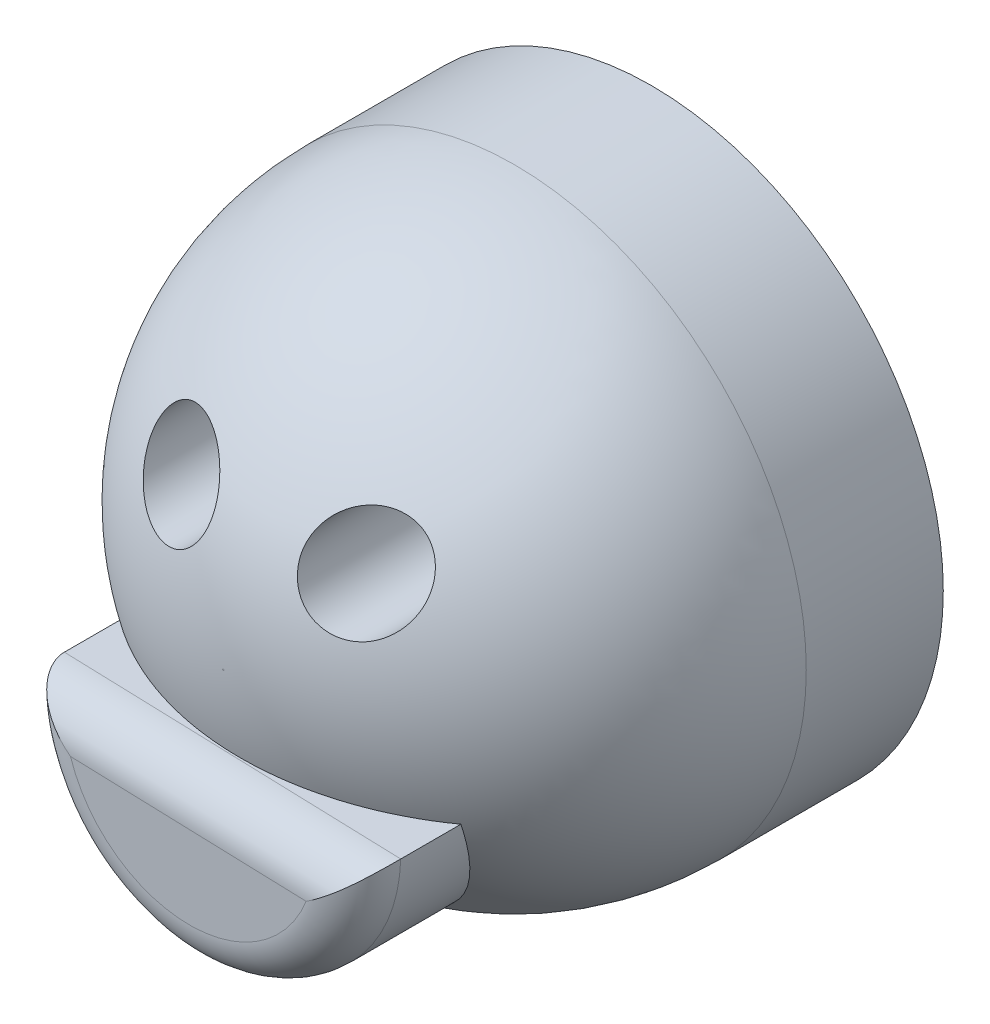
ISO-10303-21;
HEADER;
FILE_DESCRIPTION(('STEP AP214'),'2;1');
FILE_NAME('part.step','',(''),(''),'','','');
FILE_SCHEMA(('AUTOMOTIVE_DESIGN { 1 0 10303 214 1 1 1 1 }'));
ENDSEC;
DATA;
#1=APPLICATION_CONTEXT('core data for automotive mechanical design processes');
#2=APPLICATION_PROTOCOL_DEFINITION('international standard','automotive_design',2000,#1);
#3=PRODUCT_CONTEXT('',#1,'mechanical');
#4=PRODUCT('Part','Part','',(#3));
#5=PRODUCT_RELATED_PRODUCT_CATEGORY('part','',(#4));
#6=PRODUCT_DEFINITION_FORMATION('','',#4);
#7=PRODUCT_DEFINITION_CONTEXT('part definition',#1,'design');
#8=PRODUCT_DEFINITION('design','',#6,#7);
#9=PRODUCT_DEFINITION_SHAPE('','',#8);
#10=(LENGTH_UNIT() NAMED_UNIT(*) SI_UNIT(.MILLI.,.METRE.));
#11=(NAMED_UNIT(*) PLANE_ANGLE_UNIT() SI_UNIT($,.RADIAN.));
#12=(NAMED_UNIT(*) SI_UNIT($,.STERADIAN.) SOLID_ANGLE_UNIT());
#13=UNCERTAINTY_MEASURE_WITH_UNIT(LENGTH_MEASURE(1.E-05),#10,'distance_accuracy_value','');
#14=(GEOMETRIC_REPRESENTATION_CONTEXT(3) GLOBAL_UNCERTAINTY_ASSIGNED_CONTEXT((#13)) GLOBAL_UNIT_ASSIGNED_CONTEXT((#10,
#11,#12)) REPRESENTATION_CONTEXT('',''));
#15=CARTESIAN_POINT('',(0.,0.,0.));
#16=DIRECTION('',(0.,0.,1.));
#17=DIRECTION('',(1.,0.,0.));
#18=AXIS2_PLACEMENT_3D('',#15,#16,#17);
#19=CARTESIAN_POINT('',(-9.25737723848741,12.8505214496792,57.));
#20=DIRECTION('',(0.,0.,-1.));
#21=DIRECTION('',(-1.,0.,0.));
#22=AXIS2_PLACEMENT_3D('',#19,#20,#21);
#23=CYLINDRICAL_SURFACE('',#22,5.5);
#24=CARTESIAN_POINT('',(-12.9072072028845,16.9649766057103,42.5477959091102));
#25=CARTESIAN_POINT('',(-13.0140604511853,16.8701891517838,42.5563873106308));
#26=CARTESIAN_POINT('',(-13.1170758880721,16.7713597964741,42.5682582121675));
#27=CARTESIAN_POINT('',(-13.3147178261177,16.5664684033086,42.5983704048194));
#28=CARTESIAN_POINT('',(-13.4093404121222,16.4604030303369,42.6166146496213));
#29=CARTESIAN_POINT('',(-13.5897015599936,16.2418444617009,42.6592190220472));
#30=CARTESIAN_POINT('',(-13.6754258679522,16.1293413875084,42.6835887546428));
#31=CARTESIAN_POINT('',(-13.8374136016537,15.898981059377,42.7380789757917));
#32=CARTESIAN_POINT('',(-13.9136730116155,15.7811215615834,42.7682018916464));
#33=CARTESIAN_POINT('',(-14.0560204152741,15.5416764065529,42.8336078836441));
#34=CARTESIAN_POINT('',(-14.1221600944632,15.4201137656634,42.8688628121162));
#35=CARTESIAN_POINT('',(-14.2446054670298,15.1735641710642,42.9442145829014));
#36=CARTESIAN_POINT('',(-14.3009074657991,15.0485759511539,42.9843132347869));
#37=CARTESIAN_POINT('',(-14.454857651207,14.6699422650967,43.1111506170001));
#38=CARTESIAN_POINT('',(-14.5377154121831,14.4123463553259,43.2045085848092));
#39=CARTESIAN_POINT('',(-14.6691007064146,13.8733152917599,43.4128768338721));
#40=CARTESIAN_POINT('',(-14.7145081868092,13.5915669035247,43.5289985520606));
#41=CARTESIAN_POINT('',(-14.7616881300874,13.0296894637786,43.7734021902099));
#42=CARTESIAN_POINT('',(-14.7634390483365,12.7495612800146,43.9016900828656));
#43=CARTESIAN_POINT('',(-14.7227768183386,12.1587353695515,44.1848382866665));
#44=CARTESIAN_POINT('',(-14.6743397812629,11.8490463305635,44.340942380525));
#45=CARTESIAN_POINT('',(-14.5271092923104,11.2453591427245,44.6596744689687));
#46=CARTESIAN_POINT('',(-14.4282896900209,10.9513692299288,44.8223058110116));
#47=CARTESIAN_POINT('',(-14.1710647026199,10.3562882313705,45.1668199242544));
#48=CARTESIAN_POINT('',(-14.0076098553691,10.0575312709706,45.3489743842794));
#49=CARTESIAN_POINT('',(-13.6277670948659,9.49418275185944,45.7115846485517));
#50=CARTESIAN_POINT('',(-13.4113626307013,9.22960191545685,45.8920399033129));
#51=CARTESIAN_POINT('',(-13.0475652668029,8.8610915053749,46.1602677255554));
#52=CARTESIAN_POINT('',(-12.9175600985739,8.7414511789301,46.2505703404357));
#53=CARTESIAN_POINT('',(-12.6456794842515,8.51454241653131,46.4287643814814));
#54=CARTESIAN_POINT('',(-12.5038090474399,8.40726880463527,46.5166568045789));
#55=CARTESIAN_POINT('',(-12.2089926362081,8.20618856060068,46.6893998287366));
#56=CARTESIAN_POINT('',(-12.0560421432269,8.11238746973621,46.7742491674661));
#57=CARTESIAN_POINT('',(-11.7401840827872,7.93950747853151,46.9401333329919));
#58=CARTESIAN_POINT('',(-11.5772818564354,7.86042077158814,47.021170165335));
#59=CARTESIAN_POINT('',(-11.2514307253294,7.72183480327307,47.1745912012373));
#60=CARTESIAN_POINT('',(-11.0889361714544,7.66152328058421,47.2472063320046));
#61=CARTESIAN_POINT('',(-10.7572046364165,7.55611057745018,47.3877233113489));
#62=CARTESIAN_POINT('',(-10.5879711922357,7.51100153246962,47.455627582461));
#63=CARTESIAN_POINT('',(-10.2440510656069,7.4368897342342,47.5860801427284));
#64=CARTESIAN_POINT('',(-10.0693661430575,7.40788183871743,47.6486301364878));
#65=CARTESIAN_POINT('',(-9.71600008185808,7.36679177396061,47.767722236032));
#66=CARTESIAN_POINT('',(-9.5373194733823,7.3547073725788,47.8242651332197));
#67=CARTESIAN_POINT('',(-9.1969369148355,7.34850898638994,47.9249739543726));
#68=CARTESIAN_POINT('',(-9.03546653496261,7.35260866186317,47.969816887475));
#69=CARTESIAN_POINT('',(-8.71203824333144,7.3752246841211,48.0537200011101));
#70=CARTESIAN_POINT('',(-8.55008040206013,7.39373903773683,48.0927809802457));
#71=CARTESIAN_POINT('',(-8.22721404795284,7.44538724144292,48.1646673681743));
#72=CARTESIAN_POINT('',(-8.06630494636016,7.47851201291305,48.1974966311393));
#73=CARTESIAN_POINT('',(-7.7469777311678,7.5594145446557,48.2565563997379));
#74=CARTESIAN_POINT('',(-7.58855936545461,7.60719081172706,48.2827875773171));
#75=CARTESIAN_POINT('',(-7.29263845514121,7.71129064321229,48.3258719717466));
#76=CARTESIAN_POINT('',(-7.15471886997797,7.76614227416268,48.3434303807959));
#77=CARTESIAN_POINT('',(-6.8832740520946,7.88708464451781,48.3728466584016));
#78=CARTESIAN_POINT('',(-6.74974841780397,7.95317435343207,48.3847050492476));
#79=CARTESIAN_POINT('',(-6.48825395870084,8.09613879049406,48.4025905867804));
#80=CARTESIAN_POINT('',(-6.36028319951789,8.17300972420271,48.4086197791789));
#81=CARTESIAN_POINT('',(-6.11092047162358,8.3369780856974,48.4147875037095));
#82=CARTESIAN_POINT('',(-5.98952832037686,8.42407522952623,48.4149261993678));
#83=CARTESIAN_POINT('',(-5.76145008403218,8.60221035308469,48.4094826996638));
#84=CARTESIAN_POINT('',(-5.65431860697311,8.69268974604557,48.4042466494968));
#85=CARTESIAN_POINT('',(-5.44744299149838,8.88138960075264,48.3886249502624));
#86=CARTESIAN_POINT('',(-5.34770126491339,8.97961256840795,48.3782376283838));
#87=CARTESIAN_POINT('',(-5.15633597562459,9.18296832857103,48.3524177139507));
#88=CARTESIAN_POINT('',(-5.06470888440285,9.28809808279061,48.3369873281177));
#89=CARTESIAN_POINT('',(-4.89003323300438,9.50453049711651,48.3012184059297));
#90=CARTESIAN_POINT('',(-4.80698791151042,9.6158354635144,48.2808780261777));
#91=CARTESIAN_POINT('',(-4.64964251986597,9.84418276024531,48.2353847089241));
#92=CARTESIAN_POINT('',(-4.57537745670499,9.96124558514763,48.2102134915766));
#93=CARTESIAN_POINT('',(-4.43627736998531,10.1998427063166,48.1553295851225));
#94=CARTESIAN_POINT('',(-4.37144573358963,10.3213785891491,48.1256152725886));
#95=CARTESIAN_POINT('',(-4.1915175475601,10.6913293966694,48.0300235297009));
#96=CARTESIAN_POINT('',(-4.09086256834381,10.9452705643238,47.9576606481871));
#97=CARTESIAN_POINT('',(-3.92411004236922,11.4763117123146,47.7930568792736));
#98=CARTESIAN_POINT('',(-3.86047774171968,11.7538823209946,47.6998767889795));
#99=CARTESIAN_POINT('',(-3.77672643829429,12.3104261583527,47.4992830972338));
#100=CARTESIAN_POINT('',(-3.7566231049492,12.5893998559013,47.3918643849661));
#101=CARTESIAN_POINT('',(-3.75824936294008,13.169133259573,47.1545399321331));
#102=CARTESIAN_POINT('',(-3.78419991409371,13.4693996326367,47.0234646237229));
#103=CARTESIAN_POINT('',(-3.88307888847881,14.0570943266708,46.7507596073395));
#104=CARTESIAN_POINT('',(-3.9560275044973,14.3445170725682,46.6091253858552));
#105=CARTESIAN_POINT('',(-4.15520750784627,14.9297197048802,46.3032603356111));
#106=CARTESIAN_POINT('',(-4.28620142466807,15.2254547996055,46.1382132113792));
#107=CARTESIAN_POINT('',(-4.59613429052784,15.7875094903289,45.8030548950285));
#108=CARTESIAN_POINT('',(-4.77509370739228,16.0538164600907,45.6329415686714));
#109=CARTESIAN_POINT('',(-5.1914264413742,16.5702532918545,45.2784374132687));
#110=CARTESIAN_POINT('',(-5.43223969583345,16.8175527982918,45.0939570252271));
#111=CARTESIAN_POINT('',(-5.95771684512472,17.2642570289073,44.7286772221704));
#112=CARTESIAN_POINT('',(-6.24239470674187,17.4636464462555,44.5478790004139));
#113=CARTESIAN_POINT('',(-6.69854147585041,17.7222240999347,44.2829925535192));
#114=CARTESIAN_POINT('',(-6.85651916279371,17.8020321691597,44.1952239604207));
#115=CARTESIAN_POINT('',(-7.1809083446437,17.9465747755711,44.0229848076844));
#116=CARTESIAN_POINT('',(-7.34731582070793,18.011316414735,43.9385127098454));
#117=CARTESIAN_POINT('',(-7.68756804514196,18.1247876030159,43.773725358126));
#118=CARTESIAN_POINT('',(-7.86141535361511,18.1735115894429,43.6934115565001));
#119=CARTESIAN_POINT('',(-8.21517441088773,18.2539171346284,43.5379959625934));
#120=CARTESIAN_POINT('',(-8.3950823524512,18.2856091881081,43.4628909856519));
#121=CARTESIAN_POINT('',(-8.74524975668017,18.3292401892542,43.3245894771292));
#122=CARTESIAN_POINT('',(-8.91515324490112,18.3425382183777,43.2609209233383));
#123=CARTESIAN_POINT('',(-9.25756845583482,18.3531858314086,43.1397981421652));
#124=CARTESIAN_POINT('',(-9.4300785517468,18.3505449835324,43.0823402075913));
#125=CARTESIAN_POINT('',(-9.77621599596526,18.3287387738394,42.9745460268087));
#126=CARTESIAN_POINT('',(-9.94984283936479,18.3095804212292,42.9242067703331));
#127=CARTESIAN_POINT('',(-10.2965354313587,18.2543110476827,42.8315561815373));
#128=CARTESIAN_POINT('',(-10.4696012997145,18.2182039231522,42.7892430072138));
#129=CARTESIAN_POINT('',(-10.7886763589346,18.1352434155688,42.7189292919516));
#130=CARTESIAN_POINT('',(-10.9350190250191,18.0906619117056,42.689747642346));
#131=CARTESIAN_POINT('',(-11.2245450294945,17.9889822010971,42.6384146762699));
#132=CARTESIAN_POINT('',(-11.3677289611456,17.9318863671522,42.6162620289998));
#133=CARTESIAN_POINT('',(-11.6492522764025,17.805587885541,42.57942834047));
#134=CARTESIAN_POINT('',(-11.7876020438642,17.7364133821503,42.5647302337492));
#135=CARTESIAN_POINT('',(-12.0583666567901,17.5863837708901,42.5430169016915));
#136=CARTESIAN_POINT('',(-12.1907847519212,17.5055351638104,42.5359974190042));
#137=CARTESIAN_POINT('',(-12.4225361921581,17.3502033310563,42.53038950624));
#138=CARTESIAN_POINT('',(-12.5231730645919,17.277702724159,42.5303909531178));
#139=CARTESIAN_POINT('',(-12.7192350326404,17.1261372408744,42.5353738215406));
#140=CARTESIAN_POINT('',(-12.8146605769501,17.0470729311035,42.5403548136319));
#141=CARTESIAN_POINT('',(-12.9072072028845,16.9649766057103,42.5477959091102));
#142=B_SPLINE_CURVE_WITH_KNOTS('',3,(#24,#25,#26,#27,#28,#29,#30,#31,#32,#33,#34,#35,#36,#37,
#38,#39,#40,#41,#42,#43,#44,#45,#46,#47,#48,#49,#50,#51,#52,#53,#54,#55,#56,#57,#58,#59,#60,#61,
#62,#63,#64,#65,#66,#67,#68,#69,#70,#71,#72,#73,#74,#75,#76,#77,#78,#79,#80,#81,#82,#83,#84,#85,
#86,#87,#88,#89,#90,#91,#92,#93,#94,#95,#96,#97,#98,#99,#100,#101,#102,#103,#104,#105,#106,#107,
#108,#109,#110,#111,#112,#113,#114,#115,#116,#117,#118,#119,#120,#121,#122,#123,#124,#125,#126,
#127,#128,#129,#130,#131,#132,#133,#134,#135,#136,#137,#138,#139,#140,#141),.UNSPECIFIED.,.T.,
.F.,(4,2,2,2,2,2,2,2,2,2,2,2,2,2,2,2,2,2,2,2,2,2,2,2,2,2,2,2,2,2,2,2,2,2,2,2,2,2,2,2,2,2,2,2,2,
2,2,2,2,2,2,2,2,2,2,2,2,2,4),(0.,0.429156608893507,0.858512372219872,1.28854562621691,
1.71876071613443,2.14669938242189,2.57479842017683,3.43000107390439,4.35078834099497,
5.27203001016448,6.31825492510995,7.36502342309644,8.51855783251592,9.67245327366315,
10.2670814082643,10.8614597577343,11.4560818803659,12.0503876255696,12.6133919588368,
13.1761045904025,13.7386374035564,14.3010960138731,14.8033035638609,15.3054416841494,
15.8072682245018,16.3090436383955,16.7568519487563,17.2046192188607,17.6522292914413,
18.099826937907,18.5203026356711,18.9409149671652,19.3613434948465,19.7819301134367,
20.2041407778558,20.6265026689676,21.4705598384495,22.3657925837612,23.2613475388077,
24.2432623299694,25.2255992838539,26.3103606225963,27.3955855894336,28.5644825907183,
29.7337525486915,30.3257874485861,30.9175427086477,31.5095032598426,32.1010986378842,
32.6461032899422,33.1907808045525,33.7352272988403,34.2795486898858,34.7461145519053,
35.2125920263344,35.6779967320365,36.1431432669055,36.5148719894116,36.8865686554668),.UNSPECIFIED.);
#143=CARTESIAN_POINT('',(-12.9072072028845,16.9649766057103,42.5477959091102));
#144=VERTEX_POINT('',#143);
#145=EDGE_CURVE('E148',#144,#144,#142,.T.);
#146=ORIENTED_EDGE('',*,*,#145,.T.);
#147=EDGE_LOOP('',(#146));
#148=FACE_BOUND('',#147,.T.);
#149=CARTESIAN_POINT('',(-9.25737723848741,12.8505214496792,27.));
#150=DIRECTION('',(0.,0.,-1.));
#151=DIRECTION('',(-1.,0.,0.));
#152=AXIS2_PLACEMENT_3D('',#149,#150,#151);
#153=CIRCLE('',#152,5.5);
#154=CARTESIAN_POINT('',(-14.7573772384874,12.8505214496792,27.));
#155=VERTEX_POINT('',#154);
#156=EDGE_CURVE('E164',#155,#155,#153,.F.);
#157=ORIENTED_EDGE('',*,*,#156,.F.);
#158=EDGE_LOOP('',(#157));
#159=FACE_BOUND('',#158,.T.);
#160=ADVANCED_FACE('F41',(#148,#159),#23,.F.);
#161=CARTESIAN_POINT('',(11.4272316677599,12.8505214496792,57.));
#162=DIRECTION('',(0.,0.,-1.));
#163=DIRECTION('',(-1.,0.,0.));
#164=AXIS2_PLACEMENT_3D('',#161,#162,#163);
#165=CYLINDRICAL_SURFACE('',#164,5.5);
#166=CARTESIAN_POINT('',(15.2593620584543,16.7957434546768,41.386080964578));
#167=CARTESIAN_POINT('',(15.1630712113056,16.8892793943901,41.382089837552));
#168=CARTESIAN_POINT('',(15.0633025691665,16.9793259389152,41.3814197342294));
#169=CARTESIAN_POINT('',(14.8575140852864,17.1518208012796,41.3867183957662));
#170=CARTESIAN_POINT('',(14.7514931774445,17.2342678171115,41.3926882959592));
#171=CARTESIAN_POINT('',(14.5340448845873,17.3909712852645,41.4111731465244));
#172=CARTESIAN_POINT('',(14.4226152160776,17.4652242341032,41.4236908834822));
#173=CARTESIAN_POINT('',(14.19525640845,17.6050835723007,41.4550659515435));
#174=CARTESIAN_POINT('',(14.0793254992107,17.6706865145213,41.4739257994933));
#175=CARTESIAN_POINT('',(13.8443878752612,17.7926667853016,41.5175981907555));
#176=CARTESIAN_POINT('',(13.725395090283,17.8490794692541,41.5423869702517));
#177=CARTESIAN_POINT('',(13.4847739830331,17.9528459433099,41.5975866612467));
#178=CARTESIAN_POINT('',(13.3631446679101,18.0001962523783,41.6279997243579));
#179=CARTESIAN_POINT('',(12.9956702697736,18.1285118417737,41.7270505717172));
#180=CARTESIAN_POINT('',(12.7470363036936,18.1958457030698,41.8035384260418));
#181=CARTESIAN_POINT('',(12.2345506153206,18.2975820664919,41.9786524077705));
#182=CARTESIAN_POINT('',(11.9706430101019,18.3298772691214,42.07829568162));
#183=CARTESIAN_POINT('',(11.447182403148,18.3567299396451,42.2928115947896));
#184=CARTESIAN_POINT('',(11.1876312073753,18.3512721262253,42.4076903825436));
#185=CARTESIAN_POINT('',(10.6367761056727,18.3015118244145,42.6681578078188));
#186=CARTESIAN_POINT('',(10.3469565436511,18.2511920377892,42.8157283222068));
#187=CARTESIAN_POINT('',(9.78418179372839,18.107406916347,43.1215961196392));
#188=CARTESIAN_POINT('',(9.51123725229884,18.013914652658,43.279900045002));
#189=CARTESIAN_POINT('',(8.94593858044634,17.7700746492881,43.6281860196268));
#190=CARTESIAN_POINT('',(8.65709375042506,17.613177514163,43.819285487885));
#191=CARTESIAN_POINT('',(8.11319627953188,17.2520803083736,44.2053102796269));
#192=CARTESIAN_POINT('',(7.85816140467886,17.047855522253,44.4002375532183));
#193=CARTESIAN_POINT('',(7.49458851592821,16.6996781528609,44.7007831322127));
#194=CARTESIAN_POINT('',(7.37205462480495,16.5703778400781,44.8068248046676));
#195=CARTESIAN_POINT('',(7.139753319713,16.3000514378295,45.0179034409505));
#196=CARTESIAN_POINT('',(7.02998170408291,16.159029233876,45.1229407249367));
#197=CARTESIAN_POINT('',(6.82409641722177,15.8660207831036,45.3313676505475));
#198=CARTESIAN_POINT('',(6.72799212983496,15.7140271103047,45.4347561172808));
#199=CARTESIAN_POINT('',(6.55057237787206,15.4001629005672,45.6390380486835));
#200=CARTESIAN_POINT('',(6.46925008824909,15.2382969681251,45.7399326461183));
#201=CARTESIAN_POINT('',(6.3228857735391,14.9067944612122,45.9378381016312));
#202=CARTESIAN_POINT('',(6.25773697252118,14.7372181004085,46.034870675701));
#203=CARTESIAN_POINT('',(6.14408065667565,14.3905138348796,46.2249422679488));
#204=CARTESIAN_POINT('',(6.09556523838111,14.2133895617044,46.3179831643627));
#205=CARTESIAN_POINT('',(6.01618725247276,13.8528517885503,46.4992798181458));
#206=CARTESIAN_POINT('',(5.98532274578265,13.6694389817582,46.5875361001738));
#207=CARTESIAN_POINT('',(5.94226341190129,13.2978405241342,46.7583864834211));
#208=CARTESIAN_POINT('',(5.93006596866072,13.1096555458448,46.8409813764918));
#209=CARTESIAN_POINT('',(5.92551087050219,12.7490122610575,46.991749221165));
#210=CARTESIAN_POINT('',(5.93131346194215,12.5768354514235,47.0605409623662));
#211=CARTESIAN_POINT('',(5.95943178269011,12.2315229417678,47.192059572055));
#212=CARTESIAN_POINT('',(5.98174452482413,12.0583874208288,47.2547875353381));
#213=CARTESIAN_POINT('',(6.04330551271311,11.7129384934886,47.3734143328792));
#214=CARTESIAN_POINT('',(6.08253944463368,11.5406245164169,47.4293188879717));
#215=CARTESIAN_POINT('',(6.17819320235755,11.1985152609017,47.5336356835453));
#216=CARTESIAN_POINT('',(6.23461000406013,11.0287195447667,47.5820492401462));
#217=CARTESIAN_POINT('',(6.35561921804147,10.716806688413,47.6645677407794));
#218=CARTESIAN_POINT('',(6.41800324571157,10.574108146075,47.6997255117378));
#219=CARTESIAN_POINT('',(6.55532587005777,10.2933867257638,47.7635658111889));
#220=CARTESIAN_POINT('',(6.63026250766795,10.155363122215,47.7922493484677));
#221=CARTESIAN_POINT('',(6.79225914823926,9.88542570506671,47.8427751115188));
#222=CARTESIAN_POINT('',(6.87931130769202,9.75350801158735,47.8646217339737));
#223=CARTESIAN_POINT('',(7.0649859807424,9.49703560363109,47.9012134109504));
#224=CARTESIAN_POINT('',(7.16360747727383,9.37248024337338,47.9159590891387));
#225=CARTESIAN_POINT('',(7.36025674651174,9.14514998368258,47.9369399299893));
#226=CARTESIAN_POINT('',(7.45717448447346,9.04148163666993,47.9439283118399));
#227=CARTESIAN_POINT('',(7.65886060852433,8.84184239233224,47.9520378884992));
#228=CARTESIAN_POINT('',(7.76362846785999,8.74587097942587,47.9531594766204));
#229=CARTESIAN_POINT('',(7.98018785003957,8.5623953238768,47.9495237270903));
#230=CARTESIAN_POINT('',(8.09197754184119,8.47488888886485,47.944767916063));
#231=CARTESIAN_POINT('',(8.32172076220291,8.30894896578811,47.9294326147258));
#232=CARTESIAN_POINT('',(8.43967428557736,8.23051547009041,47.9188531293154));
#233=CARTESIAN_POINT('',(8.67630676835222,8.08597371043681,47.8924861954577));
#234=CARTESIAN_POINT('',(8.79479562656146,8.01951556504512,47.8769070517148));
#235=CARTESIAN_POINT('',(9.03576947190353,7.89580066197374,47.8406043579031));
#236=CARTESIAN_POINT('',(9.15825575295167,7.83854691990273,47.8198791274745));
#237=CARTESIAN_POINT('',(9.40626192667091,7.73350954092234,47.7734890202349));
#238=CARTESIAN_POINT('',(9.53178084570937,7.68572290874588,47.7478257108478));
#239=CARTESIAN_POINT('',(9.78506208074046,7.59969510073901,47.6917752811693));
#240=CARTESIAN_POINT('',(9.91282522914106,7.56145755034892,47.6613863738233));
#241=CARTESIAN_POINT('',(10.1745240047296,7.49331352674913,47.5949225376464));
#242=CARTESIAN_POINT('',(10.3085116960981,7.46377237391191,47.5586773812868));
#243=CARTESIAN_POINT('',(10.5770739725136,7.41490845652201,47.481688111214));
#244=CARTESIAN_POINT('',(10.7116487526721,7.39558939937597,47.4409423716715));
#245=CARTESIAN_POINT('',(11.1149362634672,7.35275491226462,47.3124369397168));
#246=CARTESIAN_POINT('',(11.3833831206706,7.34431853120388,47.2183653876275));
#247=CARTESIAN_POINT('',(11.9380129544381,7.36661023775826,47.0066403208464));
#248=CARTESIAN_POINT('',(12.2234995194015,7.40108386291314,46.8876028386535));
#249=CARTESIAN_POINT('',(12.7799470204244,7.51191606136265,46.6359008865442));
#250=CARTESIAN_POINT('',(13.0509013854064,7.58829341002629,46.5032303298684));
#251=CARTESIAN_POINT('',(13.6054493533355,7.79059792616674,46.2103592555308));
#252=CARTESIAN_POINT('',(13.8865134567931,7.92145556666814,46.048778302251));
#253=CARTESIAN_POINT('',(14.4188018066871,8.22510077601109,45.7161896832524));
#254=CARTESIAN_POINT('',(14.6700111115327,8.39790920965325,45.5451773595237));
#255=CARTESIAN_POINT('',(15.1658488028618,8.8024658822429,45.1768743325006));
#256=CARTESIAN_POINT('',(15.406243012369,9.03875165854647,44.9788554041236));
#257=CARTESIAN_POINT('',(15.8394443675669,9.54981213036256,44.5803046051688));
#258=CARTESIAN_POINT('',(16.0322306324498,9.82460363192847,44.3797716723244));
#259=CARTESIAN_POINT('',(16.3769163724496,10.4258836597629,43.9674364641364));
#260=CARTESIAN_POINT('',(16.525103090299,10.7546255852136,43.7558049756787));
#261=CARTESIAN_POINT('',(16.7557317643588,11.4405969021131,43.3417134510372));
#262=CARTESIAN_POINT('',(16.8381384167819,11.7978414777988,43.1392583946933));
#263=CARTESIAN_POINT('',(16.9066813644508,12.3425113211808,42.8514842659066));
#264=CARTESIAN_POINT('',(16.9205099756302,12.5231633774694,42.7592967002141));
#265=CARTESIAN_POINT('',(16.9301238794022,12.8876487535769,42.5801897421263));
#266=CARTESIAN_POINT('',(16.9259074097467,13.0714823823561,42.4932708651019));
#267=CARTESIAN_POINT('',(16.8986284139446,13.4404302039809,42.3261358103758));
#268=CARTESIAN_POINT('',(16.8755974898643,13.6255417337913,42.2459086416645));
#269=CARTESIAN_POINT('',(16.8099976975219,13.995548780046,42.0933894276284));
#270=CARTESIAN_POINT('',(16.7674381034937,14.1804443573073,42.0210936358361));
#271=CARTESIAN_POINT('',(16.6779827179335,14.4929500014459,41.9061405062903));
#272=CARTESIAN_POINT('',(16.6361887439567,14.6211578275393,41.8610847804892));
#273=CARTESIAN_POINT('',(16.5426343305105,14.8756189909872,41.7761283781066));
#274=CARTESIAN_POINT('',(16.490876210205,15.0018727757732,41.7362265055652));
#275=CARTESIAN_POINT('',(16.3774581476043,15.251355005992,41.6621576845587));
#276=CARTESIAN_POINT('',(16.3158131475569,15.3745876982722,41.6279822385293));
#277=CARTESIAN_POINT('',(16.182710097641,15.6172120897883,41.5658060196465));
#278=CARTESIAN_POINT('',(16.1112539761236,15.7366045381367,41.5378040362258));
#279=CARTESIAN_POINT('',(15.9247529173759,16.0227466511824,41.4774142805398));
#280=CARTESIAN_POINT('',(15.8044712558751,16.1868975810292,41.4486303831421));
#281=CARTESIAN_POINT('',(15.545284317651,16.5019926110259,41.4060095386949));
#282=CARTESIAN_POINT('',(15.4063766376495,16.652935002744,41.39217452256));
#283=CARTESIAN_POINT('',(15.2593620584543,16.7957434546768,41.386080964578));
#284=B_SPLINE_CURVE_WITH_KNOTS('',3,(#166,#167,#168,#169,#170,#171,#172,#173,#174,#175,#176,
#177,#178,#179,#180,#181,#182,#183,#184,#185,#186,#187,#188,#189,#190,#191,#192,#193,#194,#195,
#196,#197,#198,#199,#200,#201,#202,#203,#204,#205,#206,#207,#208,#209,#210,#211,#212,#213,#214,
#215,#216,#217,#218,#219,#220,#221,#222,#223,#224,#225,#226,#227,#228,#229,#230,#231,#232,#233,
#234,#235,#236,#237,#238,#239,#240,#241,#242,#243,#244,#245,#246,#247,#248,#249,#250,#251,#252,
#253,#254,#255,#256,#257,#258,#259,#260,#261,#262,#263,#264,#265,#266,#267,#268,#269,#270,#271,
#272,#273,#274,#275,#276,#277,#278,#279,#280,#281,#282,#283),.UNSPECIFIED.,.T.,.F.,(4,2,2,2,2,2,
2,2,2,2,2,2,2,2,2,2,2,2,2,2,2,2,2,2,2,2,2,2,2,2,2,2,2,2,2,2,2,2,2,2,2,2,2,2,2,2,2,2,2,2,2,2,2,2,
2,2,2,2,4),(0.,0.402711219229724,0.805491306174313,1.2084429452698,1.61155468351012,
2.01307701033094,2.4147532615197,3.21742152959585,4.06606799774158,4.91505799319154,
5.89855639810539,6.88266909141351,8.01871843505678,9.15536238888427,9.77668036985063,
10.3977932146025,11.0193304710949,11.6405800224867,12.2576120170403,12.8743504169149,
13.4910210507341,14.1076052548605,14.6633187945291,15.2189318137795,15.7740757524217,
16.3291220448583,16.807437656108,17.2856786868315,17.7636115353482,18.241502399991,
18.6672339750489,19.0929370084953,19.5185294910191,19.9441216154963,20.3538868126829,
20.7637859875135,21.1735552678812,21.583479887082,22.0087449509071,22.434164146696,
23.2844631765511,24.2144719124147,25.144897688407,26.1895046294941,27.2346321884285,
28.402445282393,29.5707696721768,30.8192528963423,32.0684057246941,32.6775389879102,
33.2867317392755,33.8949033469031,34.5027864301453,34.9289038139637,35.3549221382322,
35.7803025762466,36.205599526176,36.8203700550478,37.4352199830046),.UNSPECIFIED.);
#285=CARTESIAN_POINT('',(15.2593620584543,16.7957434546768,41.386080964578));
#286=VERTEX_POINT('',#285);
#287=EDGE_CURVE('E115',#286,#286,#284,.T.);
#288=ORIENTED_EDGE('',*,*,#287,.T.);
#289=EDGE_LOOP('',(#288));
#290=FACE_BOUND('',#289,.T.);
#291=CARTESIAN_POINT('',(11.4272316677599,12.8505214496792,27.));
#292=DIRECTION('',(0.,0.,-1.));
#293=DIRECTION('',(-1.,0.,0.));
#294=AXIS2_PLACEMENT_3D('',#291,#292,#293);
#295=CIRCLE('',#294,5.5);
#296=CARTESIAN_POINT('',(5.92723166775994,12.8505214496792,27.));
#297=VERTEX_POINT('',#296);
#298=EDGE_CURVE('E46',#297,#297,#295,.F.);
#299=ORIENTED_EDGE('',*,*,#298,.F.);
#300=EDGE_LOOP('',(#299));
#301=FACE_BOUND('',#300,.T.);
#302=ADVANCED_FACE('F136',(#290,#301),#165,.F.);
#303=CARTESIAN_POINT('',(0.,0.,50.));
#304=DIRECTION('',(0.,0.,-1.));
#305=DIRECTION('',(-1.,0.,0.));
#306=AXIS2_PLACEMENT_3D('',#303,#304,#305);
#307=CYLINDRICAL_SURFACE('',#306,34.075);
#308=CARTESIAN_POINT('',(0.,0.,16.));
#309=DIRECTION('',(0.,0.,1.));
#310=DIRECTION('',(1.,0.,0.));
#311=AXIS2_PLACEMENT_3D('',#308,#309,#310);
#312=CIRCLE('',#311,34.075);
#313=CARTESIAN_POINT('',(34.075,0.,16.));
#314=VERTEX_POINT('',#313);
#315=EDGE_CURVE('E102',#314,#314,#312,.F.);
#316=ORIENTED_EDGE('',*,*,#315,.T.);
#317=EDGE_LOOP('',(#316));
#318=FACE_BOUND('',#317,.T.);
#319=CARTESIAN_POINT('',(0.,0.,0.));
#320=DIRECTION('',(0.,0.,1.));
#321=DIRECTION('',(1.,0.,0.));
#322=AXIS2_PLACEMENT_3D('',#319,#320,#321);
#323=CIRCLE('',#322,34.075);
#324=CARTESIAN_POINT('',(34.075,0.,0.));
#325=VERTEX_POINT('',#324);
#326=EDGE_CURVE('E158',#325,#325,#323,.T.);
#327=ORIENTED_EDGE('',*,*,#326,.T.);
#328=EDGE_LOOP('',(#327));
#329=FACE_BOUND('',#328,.T.);
#330=ADVANCED_FACE('F140',(#318,#329),#307,.T.);
#331=CARTESIAN_POINT('',(0.,0.,50.));
#332=DIRECTION('',(0.,0.,1.));
#333=DIRECTION('',(1.,0.,0.));
#334=AXIS2_PLACEMENT_3D('',#331,#332,#333);
#335=PLANE('',#334);
#336=CARTESIAN_POINT('',(0.,0.,50.));
#337=DIRECTION('',(0.,0.,1.));
#338=DIRECTION('',(1.,0.,0.));
#339=AXIS2_PLACEMENT_3D('',#336,#337,#338);
#340=CIRCLE('',#339,0.0749999999999987);
#341=CARTESIAN_POINT('',(0.0749999999999987,0.,50.));
#342=VERTEX_POINT('',#341);
#343=EDGE_CURVE('E106',#342,#342,#340,.T.);
#344=ORIENTED_EDGE('',*,*,#343,.T.);
#345=EDGE_LOOP('',(#344));
#346=FACE_BOUND('',#345,.T.);
#347=ADVANCED_FACE('F146',(#346),#335,.T.);
#348=CARTESIAN_POINT('',(0.,0.,0.));
#349=DIRECTION('',(0.,0.,1.));
#350=DIRECTION('',(1.,0.,0.));
#351=AXIS2_PLACEMENT_3D('',#348,#349,#350);
#352=PLANE('',#351);
#353=CARTESIAN_POINT('',(0.,0.,0.));
#354=DIRECTION('',(0.,0.,-1.));
#355=DIRECTION('',(-1.,0.,0.));
#356=AXIS2_PLACEMENT_3D('',#353,#354,#355);
#357=CIRCLE('',#356,28.2538998308258);
#358=CARTESIAN_POINT('',(-28.2538998308258,0.,0.));
#359=VERTEX_POINT('',#358);
#360=EDGE_CURVE('E169',#359,#359,#357,.T.);
#361=ORIENTED_EDGE('',*,*,#360,.F.);
#362=EDGE_LOOP('',(#361));
#363=FACE_BOUND('',#362,.T.);
#364=ORIENTED_EDGE('',*,*,#326,.F.);
#365=EDGE_LOOP('',(#364));
#366=FACE_BOUND('',#365,.T.);
#367=ADVANCED_FACE('F227',(#363,#366),#352,.F.);
#368=CARTESIAN_POINT('',(0.,0.,16.));
#369=DIRECTION('',(0.,0.,1.));
#370=DIRECTION('',(1.,0.,0.));
#371=AXIS2_PLACEMENT_3D('',#368,#369,#370);
#372=DEGENERATE_TOROIDAL_SURFACE('',#371,0.0749999999999987,34.,.T.);
#373=CARTESIAN_POINT('',(-19.5558562940161,-8.50149505844834,42.5421555290233));
#374=CARTESIAN_POINT('',(-19.574931873684,-9.08816209578544,42.3409494195911));
#375=CARTESIAN_POINT('',(-19.5676115857604,-9.67478268908394,42.1373389097922));
#376=CARTESIAN_POINT('',(-19.5008178309394,-10.8437285295561,41.7265662863757));
#377=CARTESIAN_POINT('',(-19.4413501389267,-11.4260542451506,41.519404568515));
#378=CARTESIAN_POINT('',(-19.2709263680775,-12.5821883896211,41.102796118108));
#379=CARTESIAN_POINT('',(-19.1599837620751,-13.1559990066728,40.8933499974708));
#380=CARTESIAN_POINT('',(-18.9557404966956,-14.0071879976817,40.5785349779164));
#381=CARTESIAN_POINT('',(-18.8813496539943,-14.2893442913026,40.4734835081888));
#382=CARTESIAN_POINT('',(-18.7200674985225,-14.8501210308587,40.263296339725));
#383=CARTESIAN_POINT('',(-18.6331729427075,-15.1287405390052,40.1581606261958));
#384=CARTESIAN_POINT('',(-18.3537696520801,-15.9590493398021,39.8427150329233));
#385=CARTESIAN_POINT('',(-18.142668817213,-16.5046576533163,39.6325631875182));
#386=CARTESIAN_POINT('',(-17.6723277971972,-17.5755528553049,39.214361448887));
#387=CARTESIAN_POINT('',(-17.4130881685367,-18.1008399786091,39.0063115313918));
#388=CARTESIAN_POINT('',(-16.9893542364779,-18.8706298701247,38.6971494252353));
#389=CARTESIAN_POINT('',(-16.8422685895343,-19.124245523876,38.5945632803377));
#390=CARTESIAN_POINT('',(-16.5367101919853,-19.6249249492383,38.3906132103358));
#391=CARTESIAN_POINT('',(-16.378240332294,-19.8719903625567,38.2892489825189));
#392=CARTESIAN_POINT('',(-15.8859929185334,-20.6028005344686,37.9872943045139));
#393=CARTESIAN_POINT('',(-15.5353472835205,-21.0762142069937,37.7888197556714));
#394=CARTESIAN_POINT('',(-14.7925633698025,-21.9898496557298,37.4004317835713));
#395=CARTESIAN_POINT('',(-14.4005779360391,-22.4301840609211,37.2104902864922));
#396=CARTESIAN_POINT('',(-13.5762243170333,-23.2759802047022,36.8406596505168));
#397=CARTESIAN_POINT('',(-13.1438555752054,-23.6814414625027,36.6607706502243));
#398=CARTESIAN_POINT('',(-12.2412845087989,-24.45381206615,36.3135527321629));
#399=CARTESIAN_POINT('',(-11.7710834412508,-24.8207226919606,36.1462233974389));
#400=CARTESIAN_POINT('',(-10.7957611202533,-25.5123706634685,35.8268036991123));
#401=CARTESIAN_POINT('',(-10.2906422435196,-25.8371108752144,35.674712300047));
#402=CARTESIAN_POINT('',(-9.27821152616721,-26.4238693243961,35.3966325006907));
#403=CARTESIAN_POINT('',(-8.77261983126842,-26.6883875369461,35.2696572523799));
#404=CARTESIAN_POINT('',(-7.73674468770226,-27.1737915967235,35.0341898807359));
#405=CARTESIAN_POINT('',(-7.2064619246765,-27.3946786546442,34.9256972445518));
#406=CARTESIAN_POINT('',(-6.12556265332924,-27.7899665112827,34.7295976369961));
#407=CARTESIAN_POINT('',(-5.57496238332576,-27.964403555626,34.6419743866078));
#408=CARTESIAN_POINT('',(-4.45757606305382,-28.2646527772376,34.4896026669221));
#409=CARTESIAN_POINT('',(-3.89079171266523,-28.3904700412118,34.4248518047272));
#410=CARTESIAN_POINT('',(-2.80140812114292,-28.5819369238844,34.3249670760794));
#411=CARTESIAN_POINT('',(-2.27982583799317,-28.6522226096048,34.2875774153156));
#412=CARTESIAN_POINT('',(-1.23164373310717,-28.7507267797358,34.2336706233698));
#413=CARTESIAN_POINT('',(-0.705044278684795,-28.7789483202612,34.2171519758453));
#414=CARTESIAN_POINT('',(0.34879707365127,-28.792938835966,34.2053725662195));
#415=CARTESIAN_POINT('',(0.876038737560213,-28.778720272338,34.2101055644512));
#416=CARTESIAN_POINT('',(1.92705567842638,-28.7080184118749,34.240704423384));
#417=CARTESIAN_POINT('',(2.45083102773632,-28.6515360000419,34.2665698415746));
#418=CARTESIAN_POINT('',(3.46007026760678,-28.5015716451789,34.3367001835289));
#419=CARTESIAN_POINT('',(3.9459721044149,-28.4104677419924,34.3797902593406));
#420=CARTESIAN_POINT('',(4.9077533319416,-28.1924358084004,34.4833038038705));
#421=CARTESIAN_POINT('',(5.38363322865541,-28.0655095913011,34.5437263952286));
#422=CARTESIAN_POINT('',(6.32243419768074,-27.777099354159,34.6808007556705));
#423=CARTESIAN_POINT('',(6.7853540035758,-27.6156119701515,34.7574541045456));
#424=CARTESIAN_POINT('',(7.69550783016167,-27.25960424416,34.9256840601386));
#425=CARTESIAN_POINT('',(8.1427412079866,-27.0650825502583,35.0172612776045));
#426=CARTESIAN_POINT('',(9.03509359415548,-26.6370349636638,35.217502550674));
#427=CARTESIAN_POINT('',(9.47954214482195,-26.4023463868503,35.3266675098468));
#428=CARTESIAN_POINT('',(10.3466846516955,-25.9013042582397,35.5578658214005));
#429=CARTESIAN_POINT('',(10.7693782922461,-25.6349502471732,35.6798993604218));
#430=CARTESIAN_POINT('',(11.5910600415638,-25.0726005424685,35.9352269766313));
#431=CARTESIAN_POINT('',(11.990044311708,-24.7766000696935,36.0685228688158));
#432=CARTESIAN_POINT('',(12.7624993894107,-24.1570763655143,36.3447887369804));
#433=CARTESIAN_POINT('',(13.135967966034,-23.8335507330183,36.4877595567068));
#434=CARTESIAN_POINT('',(13.888285271711,-23.1307688924208,36.7951351740444));
#435=CARTESIAN_POINT('',(14.2645845404623,-22.7491178434032,36.9603103672083));
#436=CARTESIAN_POINT('',(14.9832410658418,-21.9583473038929,37.2985603116191));
#437=CARTESIAN_POINT('',(15.3255963362526,-21.5492262083495,37.4716355242676));
#438=CARTESIAN_POINT('',(15.974932383167,-20.7060794191822,37.8240824603307));
#439=CARTESIAN_POINT('',(16.2818985807722,-20.2720435711769,38.0034567392943));
#440=CARTESIAN_POINT('',(16.8590242354843,-19.3817780785944,38.366971957789));
#441=CARTESIAN_POINT('',(17.1291676569879,-18.9255388815094,38.5511149327196));
#442=CARTESIAN_POINT('',(17.6507428977937,-17.9576153814729,38.93711117289));
#443=CARTESIAN_POINT('',(17.899096762157,-17.444375697559,39.139230035985));
#444=CARTESIAN_POINT('',(18.3499616885606,-16.3992224035774,39.5455831283482));
#445=CARTESIAN_POINT('',(18.5524899841574,-15.8673159007307,39.749816532086));
#446=CARTESIAN_POINT('',(18.9104513591484,-14.7887125254786,40.1588009508333));
#447=CARTESIAN_POINT('',(19.0659280685569,-14.2420298704023,40.3635513076954));
#448=CARTESIAN_POINT('',(19.3289512855528,-13.1372358810948,40.7723182060283));
#449=CARTESIAN_POINT('',(19.4365201964603,-12.5791300167311,40.9763350461481));
#450=CARTESIAN_POINT('',(19.5748673995916,-11.6449488415279,41.3138292808942));
#451=CARTESIAN_POINT('',(19.6193104780684,-11.2710438281505,41.4478632614227));
#452=CARTESIAN_POINT('',(19.6866150314452,-10.5214903740516,41.7145258871492));
#453=CARTESIAN_POINT('',(19.7095115613004,-10.1458457678569,41.8471564667039));
#454=CARTESIAN_POINT('',(19.7215959032345,-9.76954383158628,41.9790368705521));
#455=B_SPLINE_CURVE_WITH_KNOTS('',3,(#373,#374,#375,#376,#377,#378,#379,#380,#381,#382,#383,
#384,#385,#386,#387,#388,#389,#390,#391,#392,#393,#394,#395,#396,#397,#398,#399,#400,#401,#402,
#403,#404,#405,#406,#407,#408,#409,#410,#411,#412,#413,#414,#415,#416,#417,#418,#419,#420,#421,
#422,#423,#424,#425,#426,#427,#428,#429,#430,#431,#432,#433,#434,#435,#436,#437,#438,#439,#440,
#441,#442,#443,#444,#445,#446,#447,#448,#449,#450,#451,#452,#453,#454),.UNSPECIFIED.,.F.,.F.,(4,
2,2,2,2,2,2,2,2,2,2,2,2,2,2,2,2,2,2,2,2,2,2,2,2,2,2,2,2,2,2,2,2,2,2,2,2,2,2,2,4),(0.,
1.86082397133318,3.72144189814728,5.58157310889625,6.51173564403412,7.44213986849331,
9.30468453509585,11.1672076718783,12.0987930238279,13.0301426390003,14.8926429272364,
16.7484836226058,18.6043498999933,20.4601545391429,22.3158329852372,24.0671746851733,
25.8184677814012,27.5683902866468,29.318129661643,30.8989445212298,32.4796445232086,
34.0598804483495,35.6400832843804,37.1271101690601,38.614061794741,40.1011582167448,
41.5883155123364,43.1296451351072,44.6709971157525,46.2125979700959,47.7543334404813,
49.4350387820433,51.1158424113351,52.7973360094838,54.4795595418105,56.2923013075488,
58.1043602208125,59.9147336621307,61.7242596198913,62.9227559874868,64.1192990842982),.UNSPECIFIED.);
#456=CARTESIAN_POINT('',(-19.5558627824776,-8.50169505844834,42.5420869293879));
#457=VERTEX_POINT('',#456);
#458=CARTESIAN_POINT('',(19.721395903216,-9.77573975329458,41.9768652852721));
#459=VERTEX_POINT('',#458);
#460=EDGE_CURVE('E84',#457,#459,#455,.T.);
#461=ORIENTED_EDGE('',*,*,#460,.F.);
#462=CARTESIAN_POINT('',(19.7215959032345,-9.77574624073721,41.9767115301788));
#463=CARTESIAN_POINT('',(19.3562040662645,-9.76389394892742,42.2576175312304));
#464=CARTESIAN_POINT('',(18.9849315696617,-9.75185090492518,42.5307739838413));
#465=CARTESIAN_POINT('',(18.2312041330846,-9.72740208965486,43.0611766023376));
#466=CARTESIAN_POINT('',(17.8487492313884,-9.71499631962841,43.3184228226755));
#467=CARTESIAN_POINT('',(16.6856897760568,-9.67726991563689,44.0655444588506));
#468=CARTESIAN_POINT('',(15.8891878326105,-9.65143361469738,44.5309585940248));
#469=CARTESIAN_POINT('',(14.2605870802343,-9.59860634981132,45.3925760865431));
#470=CARTESIAN_POINT('',(13.4285175869381,-9.57161633678214,45.7888351242577));
#471=CARTESIAN_POINT('',(11.7339891639324,-9.51665056218792,46.5099115693234));
#472=CARTESIAN_POINT('',(10.8715306060421,-9.48867481268367,46.834729850421));
#473=CARTESIAN_POINT('',(9.1217379123762,-9.43191641932721,47.4108800653614));
#474=CARTESIAN_POINT('',(8.23438589847588,-9.40313319555853,47.6621576217061));
#475=CARTESIAN_POINT('',(6.44171032957291,-9.34498380136536,48.089239062615));
#476=CARTESIAN_POINT('',(5.53638655254065,-9.31561762373886,48.2650420141308));
#477=CARTESIAN_POINT('',(3.71430936218783,-9.25651452297142,48.5400702606508));
#478=CARTESIAN_POINT('',(2.79755732815484,-9.22677764457072,48.6393047075772));
#479=CARTESIAN_POINT('',(0.958978619087115,-9.16713928057262,48.7607093238669));
#480=CARTESIAN_POINT('',(0.0371519660928495,-9.13723779569015,48.7828798276761));
#481=CARTESIAN_POINT('',(-1.80966878971221,-9.07733208268981,48.7499770594375));
#482=CARTESIAN_POINT('',(-2.73465613738725,-9.0473280736897,48.6945228850352));
#483=CARTESIAN_POINT('',(-4.57672856933322,-8.98757638306832,48.5059491111461));
#484=CARTESIAN_POINT('',(-5.49381337593126,-8.95782871045399,48.372826793822));
#485=CARTESIAN_POINT('',(-7.313429197317,-8.89880544962904,48.0296968091536));
#486=CARTESIAN_POINT('',(-8.21596116585821,-8.86952983048132,47.8196942018929));
#487=CARTESIAN_POINT('',(-9.99999011418732,-8.81166090853696,47.3241724183301));
#488=CARTESIAN_POINT('',(-10.8814900989141,-8.78306750826849,47.0386641011803));
#489=CARTESIAN_POINT('',(-12.4433038522944,-8.73240662730541,46.4586902701457));
#490=CARTESIAN_POINT('',(-13.1285643584589,-8.7101786882465,46.1774613247672));
#491=CARTESIAN_POINT('',(-14.4784224010042,-8.66639305922227,45.5692763145849));
#492=CARTESIAN_POINT('',(-15.1430229389462,-8.64483527189468,45.2423269305352));
#493=CARTESIAN_POINT('',(-16.4480160016638,-8.60250493765035,44.5444430384506));
#494=CARTESIAN_POINT('',(-17.0884282785378,-8.58173175003064,44.17354548939));
#495=CARTESIAN_POINT('',(-18.3428257421555,-8.54104259586794,43.3892106847972));
#496=CARTESIAN_POINT('',(-18.9568065282084,-8.52112677207107,42.9757663840294));
#497=CARTESIAN_POINT('',(-19.5560627824775,-8.50168857100631,42.5419421598181));
#498=B_SPLINE_CURVE_WITH_KNOTS('',3,(#462,#463,#464,#465,#466,#467,#468,#469,#470,#471,#472,
#473,#474,#475,#476,#477,#478,#479,#480,#481,#482,#483,#484,#485,#486,#487,#488,#489,#490,#491,
#492,#493,#494,#495,#496,#497),.UNSPECIFIED.,.F.,.F.,(4,2,2,2,2,2,2,2,2,2,2,2,2,2,2,2,2,4),(0.,
1.38291165764357,2.7658185820302,5.53086791670927,8.2936805907951,11.0564594727961,
13.8212760777685,16.5861268615642,19.3506471227697,22.1151553863607,24.8932766761167,
27.6714951863627,30.4495308735371,33.2271672435953,35.4487173661333,37.6699432102475,
39.8893141592643,42.1090532028354),.UNSPECIFIED.);
#499=EDGE_CURVE('E96',#459,#457,#498,.T.);
#500=ORIENTED_EDGE('',*,*,#499,.F.);
#501=EDGE_LOOP('',(#461,#500));
#502=FACE_BOUND('',#501,.T.);
#503=ORIENTED_EDGE('',*,*,#287,.F.);
#504=EDGE_LOOP('',(#503));
#505=FACE_BOUND('',#504,.T.);
#506=ORIENTED_EDGE('',*,*,#145,.F.);
#507=EDGE_LOOP('',(#506));
#508=FACE_BOUND('',#507,.T.);
#509=ORIENTED_EDGE('',*,*,#315,.F.);
#510=EDGE_LOOP('',(#509));
#511=FACE_BOUND('',#510,.T.);
#512=ORIENTED_EDGE('',*,*,#343,.F.);
#513=EDGE_LOOP('',(#512));
#514=FACE_BOUND('',#513,.T.);
#515=ADVANCED_FACE('F94',(#502,#505,#508,#511,#514),#372,.T.);
#516=CARTESIAN_POINT('',(0.0827665603784472,-9.13871740587176,54.));
#517=DIRECTION('',(0.,0.,-1.));
#518=DIRECTION('',(-1.,0.,0.));
#519=AXIS2_PLACEMENT_3D('',#516,#517,#518);
#520=CYLINDRICAL_SURFACE('',#519,19.6489582405074);
#521=DIRECTION('',(0.,0.,-1.));
#522=VECTOR('',#521,1.);
#523=CARTESIAN_POINT('',(19.7213959032345,-9.77573975329518,54.));
#524=LINE('',#523,#522);
#525=CARTESIAN_POINT('',(19.7213959032345,-9.77573975329518,49.));
#526=VERTEX_POINT('',#525);
#527=EDGE_CURVE('E90',#526,#459,#524,.T.);
#528=ORIENTED_EDGE('',*,*,#527,.F.);
#529=CARTESIAN_POINT('',(0.0827665603784472,-9.13871740587176,49.));
#530=DIRECTION('',(0.,0.,-1.));
#531=DIRECTION('',(-1.,0.,0.));
#532=AXIS2_PLACEMENT_3D('',#529,#530,#531);
#533=CIRCLE('',#532,19.6489582405074);
#534=CARTESIAN_POINT('',(-19.5558627824776,-8.50169505844834,49.));
#535=VERTEX_POINT('',#534);
#536=EDGE_CURVE('E11',#526,#535,#533,.T.);
#537=ORIENTED_EDGE('',*,*,#536,.T.);
#538=DIRECTION('',(0.,0.,-1.));
#539=VECTOR('',#538,1.);
#540=CARTESIAN_POINT('',(-19.5558627824776,-8.50169505844834,54.));
#541=LINE('',#540,#539);
#542=EDGE_CURVE('E80',#535,#457,#541,.T.);
#543=ORIENTED_EDGE('',*,*,#542,.T.);
#544=ORIENTED_EDGE('',*,*,#460,.T.);
#545=EDGE_LOOP('',(#528,#537,#543,#544));
#546=FACE_BOUND('',#545,.T.);
#547=ADVANCED_FACE('F83',(#546),#520,.T.);
#548=CARTESIAN_POINT('',(19.7213959032345,-9.77573975329518,54.));
#549=DIRECTION('',(0.0324201588514837,0.999474328484751,0.));
#550=DIRECTION('',(-0.999474328484751,0.0324201588514837,0.));
#551=AXIS2_PLACEMENT_3D('',#548,#549,#550);
#552=PLANE('',#551);
#553=ORIENTED_EDGE('',*,*,#542,.F.);
#554=DIRECTION('',(0.999474328484751,-0.0324201588514837,0.));
#555=VECTOR('',#554,1.);
#556=CARTESIAN_POINT('',(19.7213959032345,-9.77573975329518,49.));
#557=LINE('',#556,#555);
#558=EDGE_CURVE('E98',#535,#526,#557,.T.);
#559=ORIENTED_EDGE('',*,*,#558,.T.);
#560=ORIENTED_EDGE('',*,*,#527,.T.);
#561=ORIENTED_EDGE('',*,*,#499,.T.);
#562=EDGE_LOOP('',(#553,#559,#560,#561));
#563=FACE_BOUND('',#562,.T.);
#564=ADVANCED_FACE('F100',(#563),#552,.T.);
#565=CARTESIAN_POINT('',(0.0827665603784472,-9.13871740587176,54.));
#566=DIRECTION('',(0.,0.,-1.));
#567=DIRECTION('',(-1.,0.,0.));
#568=AXIS2_PLACEMENT_3D('',#565,#566,#567);
#569=PLANE('',#568);
#570=CARTESIAN_POINT('',(0.0827665603784472,-9.13871740587176,54.));
#571=DIRECTION('',(0.,0.,-1.));
#572=DIRECTION('',(-1.,0.,0.));
#573=AXIS2_PLACEMENT_3D('',#570,#571,#572);
#574=CIRCLE('',#573,14.6489582405074);
#575=CARTESIAN_POINT('',(-13.8413364035477,-13.6896880915731,54.));
#576=VERTEX_POINT('',#575);
#577=CARTESIAN_POINT('',(13.6826679357897,-14.582490005018,54.));
#578=VERTEX_POINT('',#577);
#579=EDGE_CURVE('E59',#576,#578,#574,.F.);
#580=ORIENTED_EDGE('',*,*,#579,.T.);
#581=DIRECTION('',(0.999474328484751,-0.0324201588514837,0.));
#582=VECTOR('',#581,1.);
#583=CARTESIAN_POINT('',(-19.717963576735,-13.4990667008721,54.));
#584=LINE('',#583,#582);
#585=EDGE_CURVE('E52',#578,#576,#584,.F.);
#586=ORIENTED_EDGE('',*,*,#585,.T.);
#587=EDGE_LOOP('',(#580,#586));
#588=FACE_BOUND('',#587,.T.);
#589=ADVANCED_FACE('F132',(#588),#569,.F.);
#590=CARTESIAN_POINT('',(0.0827665603784472,-9.13871740587176,49.));
#591=DIRECTION('',(0.,0.,-1.));
#592=DIRECTION('',(-1.,0.,0.));
#593=AXIS2_PLACEMENT_3D('',#590,#591,#592);
#594=TOROIDAL_SURFACE('',#593,14.6489582405074,5.);
#595=CARTESIAN_POINT('',(19.7213959032345,-9.77573975329518,49.));
#596=CARTESIAN_POINT('',(19.7214203561324,-9.77571270625456,49.1108387051907));
#597=CARTESIAN_POINT('',(19.7175939521134,-9.77930270542453,49.2216612473528));
#598=CARTESIAN_POINT('',(19.7024237651372,-9.79351384800601,49.4422639615718));
#599=CARTESIAN_POINT('',(19.6910850621772,-9.80413023999673,49.5520447872124));
#600=CARTESIAN_POINT('',(19.6611908102866,-9.83208264679753,49.7688602503695));
#601=CARTESIAN_POINT('',(19.6426920504137,-9.84936578161849,49.8759096021459));
#602=CARTESIAN_POINT('',(19.5987963074842,-9.89029871673096,50.0873461608971));
#603=CARTESIAN_POINT('',(19.5733985150581,-9.91394926402129,50.1917330539494));
#604=CARTESIAN_POINT('',(19.5161778978474,-9.96710584417026,50.3968750513647));
#605=CARTESIAN_POINT('',(19.4843725665404,-9.99659593060118,50.497639182217));
#606=CARTESIAN_POINT('',(19.414749132631,-10.0609674090839,50.6953030576838));
#607=CARTESIAN_POINT('',(19.3769286945272,-10.0958508950979,50.7922012829179));
#608=CARTESIAN_POINT('',(19.2550176731594,-10.2079246008457,51.0767298699696));
#609=CARTESIAN_POINT('',(19.1625347409425,-10.2924844429923,51.2579930047434));
#610=CARTESIAN_POINT('',(18.9911517277965,-10.4478475017414,51.5473341736878));
#611=CARTESIAN_POINT('',(18.9170663181843,-10.5146673093396,51.6605558440576));
#612=CARTESIAN_POINT('',(18.7613486589724,-10.6542252704762,51.8778372229379));
#613=CARTESIAN_POINT('',(18.679713951096,-10.726965350901,51.9818939253734));
#614=CARTESIAN_POINT('',(18.4248407374348,-10.9524827839268,52.2804886500606));
#615=CARTESIAN_POINT('',(18.241718969131,-11.1124789557569,52.4613104550689));
#616=CARTESIAN_POINT('',(17.911993184714,-11.3958526844472,52.7406217993742));
#617=CARTESIAN_POINT('',(17.7701098660203,-11.5164662438808,52.8478093939189));
#618=CARTESIAN_POINT('',(17.4782727125931,-11.7614758696724,53.0456297588975));
#619=CARTESIAN_POINT('',(17.3283187815283,-11.8858719811717,53.1362623316728));
#620=CARTESIAN_POINT('',(17.0215734748567,-12.1369496154314,53.3021713411894));
#621=CARTESIAN_POINT('',(16.8647713864682,-12.2636345228815,53.3774225900429));
#622=CARTESIAN_POINT('',(16.5457024889127,-12.5177646608802,53.513510051169));
#623=CARTESIAN_POINT('',(16.383436171416,-12.6452098221767,53.57434755645));
#624=CARTESIAN_POINT('',(16.0189185963225,-12.9271984981509,53.6943391296351));
#625=CARTESIAN_POINT('',(15.8155708792408,-13.0816774320485,53.7503194728208));
#626=CARTESIAN_POINT('',(15.4033983712278,-13.3886961775118,53.8443753963896));
#627=CARTESIAN_POINT('',(15.1945720962493,-13.5412354466901,53.8824460713594));
#628=CARTESIAN_POINT('',(14.5619668074638,-13.9936957550186,53.9721337428578));
#629=CARTESIAN_POINT('',(14.1312025475117,-14.2891275916793,53.99949206192));
#630=CARTESIAN_POINT('',(13.6908079354483,-14.5771695764836,53.9999976600607));
#631=CARTESIAN_POINT('',(13.6867381759395,-14.5798302295248,53.9999999957978));
#632=CARTESIAN_POINT('',(13.6826679357897,-14.582490005018,54.));
#633=B_SPLINE_CURVE_WITH_KNOTS('',3,(#595,#596,#597,#598,#599,#600,#601,#602,#603,#604,#605,
#606,#607,#608,#609,#610,#611,#612,#613,#614,#615,#616,#617,#618,#619,#620,#621,#622,#623,#624,
#625,#626,#627,#628,#629,#630,#631,#632),.UNSPECIFIED.,.F.,.F.,(4,2,2,2,2,2,2,2,2,2,2,2,2,2,2,2,
2,2,4),(0.,0.332366526025806,0.664508526901695,0.994068453987789,1.32366706055815,
1.65237772283403,1.98121632745465,2.63953411877979,3.0917146221909,3.54404289105112,
4.44924040496333,5.09309960115628,5.73696648420727,6.38187943866928,7.02673451823348,
7.81022352713358,8.59392700694162,10.1579990141367,10.1725859286706),.UNSPECIFIED.);
#634=EDGE_CURVE('E168',#578,#526,#633,.F.);
#635=ORIENTED_EDGE('',*,*,#634,.F.);
#636=ORIENTED_EDGE('',*,*,#579,.F.);
#637=CARTESIAN_POINT('',(-19.5558627824776,-8.50169505844834,49.));
#638=CARTESIAN_POINT('',(-19.5558854311554,-8.50166648356401,49.1108387051907));
#639=CARTESIAN_POINT('',(-19.5522997250708,-8.5054969109072,49.2216612473528));
#640=CARTESIAN_POINT('',(-19.5380823984686,-8.52066130244297,49.4422639615718));
#641=CARTESIAN_POINT('',(-19.5274555393477,-8.53199019598738,49.5520447872124));
#642=CARTESIAN_POINT('',(-19.4994356193504,-8.56182117695347,49.7688602503695));
#643=CARTESIAN_POINT('',(-19.4820958012006,-8.58026681526191,49.8759096021459));
#644=CARTESIAN_POINT('',(-19.4409450423084,-8.6239584216281,50.0873461608972));
#645=CARTESIAN_POINT('',(-19.4171333423082,-8.64920518756657,50.1917330539494));
#646=CARTESIAN_POINT('',(-19.3634778881865,-8.70595827814405,50.3968750513647));
#647=CARTESIAN_POINT('',(-19.3336505573409,-8.73744755619049,50.497639182217));
#648=CARTESIAN_POINT('',(-19.2683451542102,-8.80619574971809,50.6953030576838));
#649=CARTESIAN_POINT('',(-19.2328648870349,-8.84345690611479,50.7922012829179));
#650=CARTESIAN_POINT('',(-19.1184732135842,-8.9631956120379,51.0767298699697));
#651=CARTESIAN_POINT('',(-19.0316646976601,-9.05357116856933,51.2579930047434));
#652=CARTESIAN_POINT('',(-18.8707104490544,-9.21971432092479,51.5473341736878));
#653=CARTESIAN_POINT('',(-18.801111116876,-9.29119486069058,51.6605558440576));
#654=CARTESIAN_POINT('',(-18.6547650227022,-9.44055092728014,51.8778372229379));
#655=CARTESIAN_POINT('',(-18.578015932472,-9.51842853625146,51.9818939253734));
#656=CARTESIAN_POINT('',(-18.338293431615,-9.75998927441769,52.2804886500606));
#657=CARTESIAN_POINT('',(-18.1659253588866,-9.93151654493425,52.4613104550689));
#658=CARTESIAN_POINT('',(-17.85525708594,-10.2356628702542,52.7406217993742));
#659=CARTESIAN_POINT('',(-17.7214885353443,-10.3652178073054,52.8478093939189));
#660=CARTESIAN_POINT('',(-17.4461430134398,-10.6286252567409,53.0456297588975));
#661=CARTESIAN_POINT('',(-17.3045659489273,-10.7624778204145,53.1362623316728));
#662=CARTESIAN_POINT('',(-17.0147368574758,-11.0329066638075,53.3021713411894));
#663=CARTESIAN_POINT('',(-16.8664743596236,-11.1694870153566,53.3774225900429));
#664=CARTESIAN_POINT('',(-16.5645454043887,-11.4437605912207,53.513510051169));
#665=CARTESIAN_POINT('',(-16.4108794331547,-11.5814537145659,53.57434755645));
#666=CARTESIAN_POINT('',(-16.0654027464678,-11.8864726236282,53.6943391296351));
#667=CARTESIAN_POINT('',(-15.872493691197,-12.0538050217314,53.7503194728208));
#668=CARTESIAN_POINT('',(-15.4810843531319,-12.3868897204239,53.8443753963896));
#669=CARTESIAN_POINT('',(-15.2825825542601,-12.5526415759413,53.8824460713594));
#670=CARTESIAN_POINT('',(-14.6806293343436,-13.0451475180825,53.9721337428578));
#671=CARTESIAN_POINT('',(-14.2699164227706,-13.3678745266084,53.99949206192));
#672=CARTESIAN_POINT('',(-13.8491144949098,-13.6838513245748,53.9999976600607));
#673=CARTESIAN_POINT('',(-13.8452257174793,-13.6867701303513,53.9999999957978));
#674=CARTESIAN_POINT('',(-13.8413364035476,-13.6896880915731,54.));
#675=B_SPLINE_CURVE_WITH_KNOTS('',3,(#637,#638,#639,#640,#641,#642,#643,#644,#645,#646,#647,
#648,#649,#650,#651,#652,#653,#654,#655,#656,#657,#658,#659,#660,#661,#662,#663,#664,#665,#666,
#667,#668,#669,#670,#671,#672,#673,#674),.UNSPECIFIED.,.F.,.F.,(4,2,2,2,2,2,2,2,2,2,2,2,2,2,2,2,
2,2,4),(0.,0.332366526025805,0.664508526901695,0.994068453987796,1.32366706055815,
1.65237772283405,1.98121632745466,2.63953411877979,3.0917146221909,3.54404289105113,
4.44924040496333,5.09309960115627,5.73696648420726,6.38187943866927,7.02673451823348,
7.81022352713358,8.59392700694164,10.1579990141367,10.1725859286706),.UNSPECIFIED.);
#676=EDGE_CURVE('E66',#535,#576,#675,.T.);
#677=ORIENTED_EDGE('',*,*,#676,.F.);
#678=ORIENTED_EDGE('',*,*,#536,.F.);
#679=EDGE_LOOP('',(#635,#636,#677,#678));
#680=FACE_BOUND('',#679,.T.);
#681=ADVANCED_FACE('F195',(#680),#594,.T.);
#682=CARTESIAN_POINT('',(19.559295108977,-14.7731113957189,49.));
#683=DIRECTION('',(-0.999474328484751,0.0324201588514837,0.));
#684=DIRECTION('',(-0.0324201588514837,-0.999474328484751,0.));
#685=AXIS2_PLACEMENT_3D('',#682,#683,#684);
#686=CYLINDRICAL_SURFACE('',#685,5.);
#687=ORIENTED_EDGE('',*,*,#676,.T.);
#688=ORIENTED_EDGE('',*,*,#585,.F.);
#689=ORIENTED_EDGE('',*,*,#634,.T.);
#690=ORIENTED_EDGE('',*,*,#558,.F.);
#691=EDGE_LOOP('',(#687,#688,#689,#690));
#692=FACE_BOUND('',#691,.T.);
#693=ADVANCED_FACE('F43',(#692),#686,.T.);
#694=CARTESIAN_POINT('',(0.,0.,27.));
#695=DIRECTION('',(0.,0.,-1.));
#696=DIRECTION('',(-1.,0.,0.));
#697=AXIS2_PLACEMENT_3D('',#694,#695,#696);
#698=PLANE('',#697);
#699=CARTESIAN_POINT('',(0.,0.,27.));
#700=DIRECTION('',(0.,0.,-1.));
#701=DIRECTION('',(-1.,0.,0.));
#702=AXIS2_PLACEMENT_3D('',#699,#700,#701);
#703=CIRCLE('',#702,28.2538998308258);
#704=CARTESIAN_POINT('',(-28.2538998308258,0.,27.));
#705=VERTEX_POINT('',#704);
#706=EDGE_CURVE('E173',#705,#705,#703,.T.);
#707=ORIENTED_EDGE('',*,*,#706,.T.);
#708=EDGE_LOOP('',(#707));
#709=FACE_BOUND('',#708,.T.);
#710=ORIENTED_EDGE('',*,*,#298,.T.);
#711=EDGE_LOOP('',(#710));
#712=FACE_BOUND('',#711,.T.);
#713=ORIENTED_EDGE('',*,*,#156,.T.);
#714=EDGE_LOOP('',(#713));
#715=FACE_BOUND('',#714,.T.);
#716=ADVANCED_FACE('F182',(#709,#712,#715),#698,.T.);
#717=CARTESIAN_POINT('',(0.,0.,27.));
#718=DIRECTION('',(0.,0.,-1.));
#719=DIRECTION('',(-1.,0.,0.));
#720=AXIS2_PLACEMENT_3D('',#717,#718,#719);
#721=CYLINDRICAL_SURFACE('',#720,28.2538998308258);
#722=ORIENTED_EDGE('',*,*,#706,.F.);
#723=EDGE_LOOP('',(#722));
#724=FACE_BOUND('',#723,.T.);
#725=ORIENTED_EDGE('',*,*,#360,.T.);
#726=EDGE_LOOP('',(#725));
#727=FACE_BOUND('',#726,.T.);
#728=ADVANCED_FACE('F186',(#724,#727),#721,.F.);
#729=CLOSED_SHELL('',(#160,#302,#330,#347,#367,#515,#547,#564,#589,#681,#693,#716,#728));
#730=MANIFOLD_SOLID_BREP('B2',#729);
#731=ADVANCED_BREP_SHAPE_REPRESENTATION('',(#18,#730),#14);
#732=SHAPE_DEFINITION_REPRESENTATION(#9,#731);
ENDSEC;
END-ISO-10303-21;
